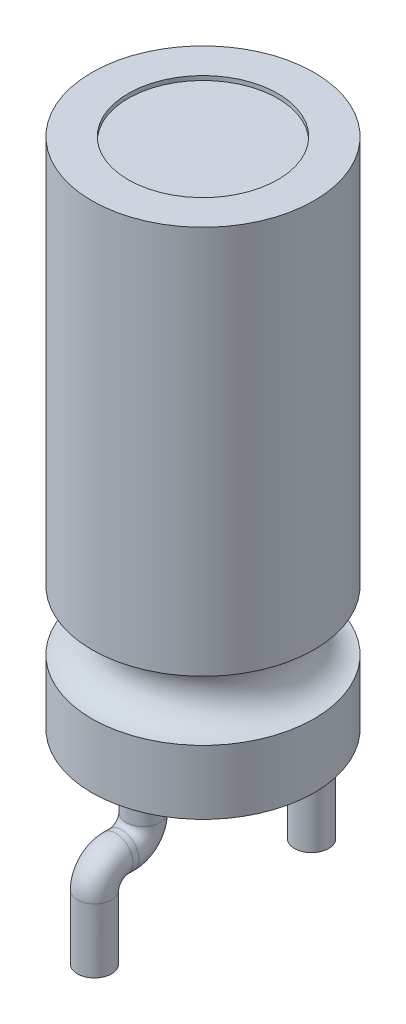
ISO-10303-21;
HEADER;
FILE_DESCRIPTION(('STEP AP214'),'2;1');
FILE_NAME('part.step','',(''),(''),'','','');
FILE_SCHEMA(('AUTOMOTIVE_DESIGN { 1 0 10303 214 1 1 1 1 }'));
ENDSEC;
DATA;
#1=APPLICATION_CONTEXT('core data for automotive mechanical design processes');
#2=APPLICATION_PROTOCOL_DEFINITION('international standard','automotive_design',2000,#1);
#3=PRODUCT_CONTEXT('',#1,'mechanical');
#4=PRODUCT('Part','Part','',(#3));
#5=PRODUCT_RELATED_PRODUCT_CATEGORY('part','',(#4));
#6=PRODUCT_DEFINITION_FORMATION('','',#4);
#7=PRODUCT_DEFINITION_CONTEXT('part definition',#1,'design');
#8=PRODUCT_DEFINITION('design','',#6,#7);
#9=PRODUCT_DEFINITION_SHAPE('','',#8);
#10=(LENGTH_UNIT() NAMED_UNIT(*) SI_UNIT(.MILLI.,.METRE.));
#11=(NAMED_UNIT(*) PLANE_ANGLE_UNIT() SI_UNIT($,.RADIAN.));
#12=(NAMED_UNIT(*) SI_UNIT($,.STERADIAN.) SOLID_ANGLE_UNIT());
#13=UNCERTAINTY_MEASURE_WITH_UNIT(LENGTH_MEASURE(1.E-05),#10,'distance_accuracy_value','');
#14=(GEOMETRIC_REPRESENTATION_CONTEXT(3) GLOBAL_UNCERTAINTY_ASSIGNED_CONTEXT((#13)) GLOBAL_UNIT_ASSIGNED_CONTEXT((#10,
#11,#12)) REPRESENTATION_CONTEXT('',''));
#15=CARTESIAN_POINT('',(0.,0.,0.));
#16=DIRECTION('',(0.,0.,1.));
#17=DIRECTION('',(1.,0.,0.));
#18=AXIS2_PLACEMENT_3D('',#15,#16,#17);
#19=CARTESIAN_POINT('',(2.6,27.5164236634825,0.));
#20=DIRECTION('',(0.,1.,0.));
#21=DIRECTION('',(0.,0.,1.));
#22=AXIS2_PLACEMENT_3D('',#19,#20,#21);
#23=PLANE('',#22);
#24=CARTESIAN_POINT('',(0.,27.5164236634825,1.4));
#25=DIRECTION('',(0.,-1.,0.));
#26=DIRECTION('',(0.,0.,-1.));
#27=AXIS2_PLACEMENT_3D('',#24,#25,#26);
#28=CIRCLE('',#27,0.4);
#29=CARTESIAN_POINT('',(0.,27.5164236634825,1.));
#30=VERTEX_POINT('',#29);
#31=EDGE_CURVE('E41',#30,#30,#28,.T.);
#32=ORIENTED_EDGE('',*,*,#31,.F.);
#33=EDGE_LOOP('',(#32));
#34=FACE_BOUND('',#33,.T.);
#35=CARTESIAN_POINT('',(0.,27.5164236634825,0.));
#36=DIRECTION('',(0.,1.,0.));
#37=DIRECTION('',(0.,0.,1.));
#38=AXIS2_PLACEMENT_3D('',#35,#36,#37);
#39=CIRCLE('',#38,2.6);
#40=CARTESIAN_POINT('',(0.,27.5164236634825,2.6));
#41=VERTEX_POINT('',#40);
#42=EDGE_CURVE('E37',#41,#41,#39,.T.);
#43=ORIENTED_EDGE('',*,*,#42,.F.);
#44=EDGE_LOOP('',(#43));
#45=FACE_BOUND('',#44,.T.);
#46=CARTESIAN_POINT('',(0.,27.5164236634825,-1.4));
#47=DIRECTION('',(0.,-1.,0.));
#48=DIRECTION('',(0.,0.,-1.));
#49=AXIS2_PLACEMENT_3D('',#46,#47,#48);
#50=CIRCLE('',#49,0.4);
#51=CARTESIAN_POINT('',(0.,27.5164236634825,-1.8));
#52=VERTEX_POINT('',#51);
#53=EDGE_CURVE('E10',#52,#52,#50,.T.);
#54=ORIENTED_EDGE('',*,*,#53,.F.);
#55=EDGE_LOOP('',(#54));
#56=FACE_BOUND('',#55,.T.);
#57=ADVANCED_FACE('F34',(#34,#45,#56),#23,.F.);
#58=CARTESIAN_POINT('',(0.,48.4017094017094,0.));
#59=DIRECTION('',(0.,1.,0.));
#60=DIRECTION('',(0.,0.,1.));
#61=AXIS2_PLACEMENT_3D('',#58,#59,#60);
#62=CYLINDRICAL_SURFACE('',#61,2.6);
#63=CARTESIAN_POINT('',(0.,29.0164236634825,0.));
#64=DIRECTION('',(0.,1.,0.));
#65=DIRECTION('',(0.,0.,1.));
#66=AXIS2_PLACEMENT_3D('',#63,#64,#65);
#67=CIRCLE('',#66,2.6);
#68=CARTESIAN_POINT('',(0.,29.0164236634825,2.6));
#69=VERTEX_POINT('',#68);
#70=EDGE_CURVE('E89',#69,#69,#67,.T.);
#71=ORIENTED_EDGE('',*,*,#70,.F.);
#72=EDGE_LOOP('',(#71));
#73=FACE_BOUND('',#72,.T.);
#74=ORIENTED_EDGE('',*,*,#42,.T.);
#75=EDGE_LOOP('',(#74));
#76=FACE_BOUND('',#75,.T.);
#77=ADVANCED_FACE('F96',(#73,#76),#62,.T.);
#78=CARTESIAN_POINT('',(0.,29.7164236634825,0.));
#79=DIRECTION('',(0.,1.,0.));
#80=DIRECTION('',(0.,0.,1.));
#81=AXIS2_PLACEMENT_3D('',#78,#79,#80);
#82=TOROIDAL_SURFACE('',#81,2.6,0.699999999999999);
#83=CARTESIAN_POINT('',(0.,30.4164236634825,0.));
#84=DIRECTION('',(0.,1.,0.));
#85=DIRECTION('',(0.,0.,1.));
#86=AXIS2_PLACEMENT_3D('',#83,#84,#85);
#87=CIRCLE('',#86,2.6);
#88=CARTESIAN_POINT('',(0.,30.4164236634825,2.6));
#89=VERTEX_POINT('',#88);
#90=EDGE_CURVE('E87',#89,#89,#87,.T.);
#91=ORIENTED_EDGE('',*,*,#90,.F.);
#92=EDGE_LOOP('',(#91));
#93=FACE_BOUND('',#92,.T.);
#94=ORIENTED_EDGE('',*,*,#70,.T.);
#95=EDGE_LOOP('',(#94));
#96=FACE_BOUND('',#95,.T.);
#97=ADVANCED_FACE('F104',(#93,#96),#82,.F.);
#98=CARTESIAN_POINT('',(0.,48.4017094017094,0.));
#99=DIRECTION('',(0.,1.,0.));
#100=DIRECTION('',(0.,0.,1.));
#101=AXIS2_PLACEMENT_3D('',#98,#99,#100);
#102=CYLINDRICAL_SURFACE('',#101,2.6);
#103=CARTESIAN_POINT('',(0.,39.5164236634825,0.));
#104=DIRECTION('',(0.,1.,0.));
#105=DIRECTION('',(0.,0.,1.));
#106=AXIS2_PLACEMENT_3D('',#103,#104,#105);
#107=CIRCLE('',#106,2.6);
#108=CARTESIAN_POINT('',(0.,39.5164236634825,2.6));
#109=VERTEX_POINT('',#108);
#110=EDGE_CURVE('E84',#109,#109,#107,.T.);
#111=ORIENTED_EDGE('',*,*,#110,.F.);
#112=EDGE_LOOP('',(#111));
#113=FACE_BOUND('',#112,.T.);
#114=ORIENTED_EDGE('',*,*,#90,.T.);
#115=EDGE_LOOP('',(#114));
#116=FACE_BOUND('',#115,.T.);
#117=ADVANCED_FACE('F149',(#113,#116),#102,.T.);
#118=CARTESIAN_POINT('',(0.,39.5164236634825,0.));
#119=DIRECTION('',(0.,-1.,0.));
#120=DIRECTION('',(0.,0.,-1.));
#121=AXIS2_PLACEMENT_3D('',#118,#119,#120);
#122=PLANE('',#121);
#123=CARTESIAN_POINT('',(0.,39.5164236634825,0.));
#124=DIRECTION('',(0.,1.,0.));
#125=DIRECTION('',(0.,0.,1.));
#126=AXIS2_PLACEMENT_3D('',#123,#124,#125);
#127=CIRCLE('',#126,1.75);
#128=CARTESIAN_POINT('',(0.,39.5164236634825,1.75));
#129=VERTEX_POINT('',#128);
#130=EDGE_CURVE('E78',#129,#129,#127,.T.);
#131=ORIENTED_EDGE('',*,*,#130,.F.);
#132=EDGE_LOOP('',(#131));
#133=FACE_BOUND('',#132,.T.);
#134=ORIENTED_EDGE('',*,*,#110,.T.);
#135=EDGE_LOOP('',(#134));
#136=FACE_BOUND('',#135,.T.);
#137=ADVANCED_FACE('F145',(#133,#136),#122,.F.);
#138=CARTESIAN_POINT('',(0.,39.4164236634825,0.));
#139=DIRECTION('',(0.,1.,0.));
#140=DIRECTION('',(0.,0.,1.));
#141=AXIS2_PLACEMENT_3D('',#138,#139,#140);
#142=CYLINDRICAL_SURFACE('',#141,1.75);
#143=CARTESIAN_POINT('',(0.,39.4164236634825,0.));
#144=DIRECTION('',(0.,1.,0.));
#145=DIRECTION('',(0.,0.,1.));
#146=AXIS2_PLACEMENT_3D('',#143,#144,#145);
#147=CIRCLE('',#146,1.75);
#148=CARTESIAN_POINT('',(0.,39.4164236634825,1.75));
#149=VERTEX_POINT('',#148);
#150=EDGE_CURVE('E81',#149,#149,#147,.T.);
#151=ORIENTED_EDGE('',*,*,#150,.F.);
#152=EDGE_LOOP('',(#151));
#153=FACE_BOUND('',#152,.T.);
#154=ORIENTED_EDGE('',*,*,#130,.T.);
#155=EDGE_LOOP('',(#154));
#156=FACE_BOUND('',#155,.T.);
#157=ADVANCED_FACE('F141',(#153,#156),#142,.F.);
#158=CARTESIAN_POINT('',(0.,39.4164236634825,0.));
#159=DIRECTION('',(0.,1.,0.));
#160=DIRECTION('',(0.,0.,1.));
#161=AXIS2_PLACEMENT_3D('',#158,#159,#160);
#162=PLANE('',#161);
#163=ORIENTED_EDGE('',*,*,#150,.T.);
#164=EDGE_LOOP('',(#163));
#165=FACE_BOUND('',#164,.T.);
#166=ADVANCED_FACE('F137',(#165),#162,.T.);
#167=CARTESIAN_POINT('',(0.,25.5164236634825,2.54));
#168=DIRECTION('',(0.,-1.,0.));
#169=DIRECTION('',(0.,0.,-1.));
#170=AXIS2_PLACEMENT_3D('',#167,#168,#169);
#171=CYLINDRICAL_SURFACE('',#170,0.4);
#172=CARTESIAN_POINT('',(0.,25.5164236634825,2.54));
#173=DIRECTION('',(0.,-1.,0.));
#174=DIRECTION('',(0.,0.,-1.));
#175=AXIS2_PLACEMENT_3D('',#172,#173,#174);
#176=CIRCLE('',#175,0.4);
#177=CARTESIAN_POINT('',(0.,25.5164236634825,2.94));
#178=VERTEX_POINT('',#177);
#179=EDGE_CURVE('E72',#178,#178,#176,.T.);
#180=ORIENTED_EDGE('',*,*,#179,.T.);
#181=EDGE_LOOP('',(#180));
#182=FACE_BOUND('',#181,.T.);
#183=CARTESIAN_POINT('',(0.,24.0164236634825,2.54));
#184=DIRECTION('',(0.,-1.,0.));
#185=DIRECTION('',(0.,0.,-1.));
#186=AXIS2_PLACEMENT_3D('',#183,#184,#185);
#187=CIRCLE('',#186,0.4);
#188=CARTESIAN_POINT('',(0.,24.0164236634825,2.14));
#189=VERTEX_POINT('',#188);
#190=EDGE_CURVE('E75',#189,#189,#187,.T.);
#191=ORIENTED_EDGE('',*,*,#190,.F.);
#192=EDGE_LOOP('',(#191));
#193=FACE_BOUND('',#192,.T.);
#194=ADVANCED_FACE('F133',(#182,#193),#171,.T.);
#195=CARTESIAN_POINT('',(0.,25.5164236634825,2.04));
#196=DIRECTION('',(1.,0.,0.));
#197=DIRECTION('',(0.,0.,-1.));
#198=AXIS2_PLACEMENT_3D('',#195,#196,#197);
#199=TOROIDAL_SURFACE('',#198,0.500000000000004,0.4);
#200=CARTESIAN_POINT('',(0.,26.0164236634825,2.04));
#201=DIRECTION('',(0.,0.,1.));
#202=DIRECTION('',(0.,-1.,0.));
#203=AXIS2_PLACEMENT_3D('',#200,#201,#202);
#204=CIRCLE('',#203,0.4);
#205=CARTESIAN_POINT('',(0.,26.4164236634825,2.03999999999999));
#206=VERTEX_POINT('',#205);
#207=EDGE_CURVE('E69',#206,#206,#204,.T.);
#208=CARTESIAN_POINT('',(0.,25.5164236634825,2.04));
#209=DIRECTION('',(1.,0.,0.));
#210=DIRECTION('',(0.,0.,-1.));
#211=AXIS2_PLACEMENT_3D('',#208,#209,#210);
#212=CIRCLE('',#211,0.900000000000004);
#213=EDGE_CURVE('',#206,#178,#212,.T.);
#214=ORIENTED_EDGE('',*,*,#207,.T.);
#215=ORIENTED_EDGE('',*,*,#179,.F.);
#216=ORIENTED_EDGE('',*,*,#213,.T.);
#217=ORIENTED_EDGE('',*,*,#213,.F.);
#218=EDGE_LOOP('',(#214,#216,#215,#217));
#219=FACE_BOUND('',#218,.T.);
#220=ADVANCED_FACE('F129',(#219),#199,.T.);
#221=CARTESIAN_POINT('',(0.,26.0164236634825,1.90000000000003));
#222=DIRECTION('',(0.,0.,1.));
#223=DIRECTION('',(1.,0.,0.));
#224=AXIS2_PLACEMENT_3D('',#221,#222,#223);
#225=CYLINDRICAL_SURFACE('',#224,0.4);
#226=CARTESIAN_POINT('',(0.,26.0164236634825,1.90000000000003));
#227=DIRECTION('',(0.,0.,1.));
#228=DIRECTION('',(0.,-1.,0.));
#229=AXIS2_PLACEMENT_3D('',#226,#227,#228);
#230=CIRCLE('',#229,0.4);
#231=CARTESIAN_POINT('',(0.,25.6164236634825,1.90000000000005));
#232=VERTEX_POINT('',#231);
#233=EDGE_CURVE('E66',#232,#232,#230,.T.);
#234=ORIENTED_EDGE('',*,*,#233,.T.);
#235=EDGE_LOOP('',(#234));
#236=FACE_BOUND('',#235,.T.);
#237=ORIENTED_EDGE('',*,*,#207,.F.);
#238=EDGE_LOOP('',(#237));
#239=FACE_BOUND('',#238,.T.);
#240=ADVANCED_FACE('F121',(#236,#239),#225,.T.);
#241=CARTESIAN_POINT('',(0.,26.5164236634825,1.9));
#242=DIRECTION('',(-1.,0.,0.));
#243=DIRECTION('',(0.,0.,1.));
#244=AXIS2_PLACEMENT_3D('',#241,#242,#243);
#245=TOROIDAL_SURFACE('',#244,0.5,0.4);
#246=CARTESIAN_POINT('',(0.,26.5164236634825,1.4));
#247=DIRECTION('',(0.,-1.,0.));
#248=DIRECTION('',(0.,0.,-1.));
#249=AXIS2_PLACEMENT_3D('',#246,#247,#248);
#250=CIRCLE('',#249,0.4);
#251=CARTESIAN_POINT('',(0.,26.5164236634825,1.));
#252=VERTEX_POINT('',#251);
#253=EDGE_CURVE('E62',#252,#252,#250,.T.);
#254=CARTESIAN_POINT('',(0.,26.5164236634825,1.9));
#255=DIRECTION('',(-1.,0.,0.));
#256=DIRECTION('',(0.,0.,1.));
#257=AXIS2_PLACEMENT_3D('',#254,#255,#256);
#258=CIRCLE('',#257,0.9);
#259=EDGE_CURVE('',#252,#232,#258,.T.);
#260=ORIENTED_EDGE('',*,*,#253,.T.);
#261=ORIENTED_EDGE('',*,*,#233,.F.);
#262=ORIENTED_EDGE('',*,*,#259,.T.);
#263=ORIENTED_EDGE('',*,*,#259,.F.);
#264=EDGE_LOOP('',(#260,#262,#261,#263));
#265=FACE_BOUND('',#264,.T.);
#266=ADVANCED_FACE('F111',(#265),#245,.T.);
#267=CARTESIAN_POINT('',(0.,26.5164236634825,1.4));
#268=DIRECTION('',(0.,1.,0.));
#269=DIRECTION('',(0.,0.,1.));
#270=AXIS2_PLACEMENT_3D('',#267,#268,#269);
#271=CYLINDRICAL_SURFACE('',#270,0.4);
#272=ORIENTED_EDGE('',*,*,#253,.F.);
#273=EDGE_LOOP('',(#272));
#274=FACE_BOUND('',#273,.T.);
#275=ORIENTED_EDGE('',*,*,#31,.T.);
#276=EDGE_LOOP('',(#275));
#277=FACE_BOUND('',#276,.T.);
#278=ADVANCED_FACE('F108',(#274,#277),#271,.T.);
#279=CARTESIAN_POINT('',(0.,24.0164236634825,2.54));
#280=DIRECTION('',(0.,-1.,0.));
#281=DIRECTION('',(0.,0.,-1.));
#282=AXIS2_PLACEMENT_3D('',#279,#280,#281);
#283=PLANE('',#282);
#284=ORIENTED_EDGE('',*,*,#190,.T.);
#285=EDGE_LOOP('',(#284));
#286=FACE_BOUND('',#285,.T.);
#287=ADVANCED_FACE('F110',(#286),#283,.T.);
#288=CARTESIAN_POINT('',(0.,25.5164236634825,-2.54));
#289=DIRECTION('',(0.,-1.,0.));
#290=DIRECTION('',(0.,0.,-1.));
#291=AXIS2_PLACEMENT_3D('',#288,#289,#290);
#292=CYLINDRICAL_SURFACE('',#291,0.4);
#293=CARTESIAN_POINT('',(0.,25.5164236634825,-2.54));
#294=DIRECTION('',(0.,-1.,0.));
#295=DIRECTION('',(0.,0.,-1.));
#296=AXIS2_PLACEMENT_3D('',#293,#294,#295);
#297=CIRCLE('',#296,0.4);
#298=CARTESIAN_POINT('',(0.,25.5164236634825,-2.94));
#299=VERTEX_POINT('',#298);
#300=EDGE_CURVE('E57',#299,#299,#297,.T.);
#301=ORIENTED_EDGE('',*,*,#300,.T.);
#302=EDGE_LOOP('',(#301));
#303=FACE_BOUND('',#302,.T.);
#304=CARTESIAN_POINT('',(0.,24.0164236634825,-2.54));
#305=DIRECTION('',(0.,-1.,0.));
#306=DIRECTION('',(0.,0.,-1.));
#307=AXIS2_PLACEMENT_3D('',#304,#305,#306);
#308=CIRCLE('',#307,0.4);
#309=CARTESIAN_POINT('',(0.,24.0164236634825,-2.94));
#310=VERTEX_POINT('',#309);
#311=EDGE_CURVE('E60',#310,#310,#308,.T.);
#312=ORIENTED_EDGE('',*,*,#311,.F.);
#313=EDGE_LOOP('',(#312));
#314=FACE_BOUND('',#313,.T.);
#315=ADVANCED_FACE('F118',(#303,#314),#292,.T.);
#316=CARTESIAN_POINT('',(0.,25.5164236634825,-2.04));
#317=DIRECTION('',(-1.,0.,0.));
#318=DIRECTION('',(0.,0.,1.));
#319=AXIS2_PLACEMENT_3D('',#316,#317,#318);
#320=TOROIDAL_SURFACE('',#319,0.500000000000004,0.4);
#321=CARTESIAN_POINT('',(0.,26.0164236634825,-2.03999999999999));
#322=DIRECTION('',(0.,0.,-1.));
#323=DIRECTION('',(0.,1.,0.));
#324=AXIS2_PLACEMENT_3D('',#321,#322,#323);
#325=CIRCLE('',#324,0.4);
#326=CARTESIAN_POINT('',(0.,26.4164236634825,-2.03999999999999));
#327=VERTEX_POINT('',#326);
#328=EDGE_CURVE('E54',#327,#327,#325,.T.);
#329=CARTESIAN_POINT('',(0.,25.5164236634825,-2.04));
#330=DIRECTION('',(-1.,0.,0.));
#331=DIRECTION('',(0.,0.,1.));
#332=AXIS2_PLACEMENT_3D('',#329,#330,#331);
#333=CIRCLE('',#332,0.900000000000004);
#334=EDGE_CURVE('',#327,#299,#333,.T.);
#335=ORIENTED_EDGE('',*,*,#328,.T.);
#336=ORIENTED_EDGE('',*,*,#300,.F.);
#337=ORIENTED_EDGE('',*,*,#334,.T.);
#338=ORIENTED_EDGE('',*,*,#334,.F.);
#339=EDGE_LOOP('',(#335,#337,#336,#338));
#340=FACE_BOUND('',#339,.T.);
#341=ADVANCED_FACE('F214',(#340),#320,.T.);
#342=CARTESIAN_POINT('',(0.,26.0164236634825,-1.9));
#343=DIRECTION('',(0.,0.,-1.));
#344=DIRECTION('',(-1.,0.,0.));
#345=AXIS2_PLACEMENT_3D('',#342,#343,#344);
#346=CYLINDRICAL_SURFACE('',#345,0.4);
#347=CARTESIAN_POINT('',(0.,26.0164236634825,-1.9));
#348=DIRECTION('',(0.,0.,-1.));
#349=DIRECTION('',(0.,1.,0.));
#350=AXIS2_PLACEMENT_3D('',#347,#348,#349);
#351=CIRCLE('',#350,0.4);
#352=CARTESIAN_POINT('',(0.,25.6164236634825,-1.9));
#353=VERTEX_POINT('',#352);
#354=EDGE_CURVE('E51',#353,#353,#351,.T.);
#355=ORIENTED_EDGE('',*,*,#354,.T.);
#356=EDGE_LOOP('',(#355));
#357=FACE_BOUND('',#356,.T.);
#358=ORIENTED_EDGE('',*,*,#328,.F.);
#359=EDGE_LOOP('',(#358));
#360=FACE_BOUND('',#359,.T.);
#361=ADVANCED_FACE('F223',(#357,#360),#346,.T.);
#362=CARTESIAN_POINT('',(0.,26.5164236634825,-1.9));
#363=DIRECTION('',(1.,0.,0.));
#364=DIRECTION('',(0.,0.,-1.));
#365=AXIS2_PLACEMENT_3D('',#362,#363,#364);
#366=TOROIDAL_SURFACE('',#365,0.5,0.4);
#367=CARTESIAN_POINT('',(0.,26.5164236634825,-1.4));
#368=DIRECTION('',(0.,-1.,0.));
#369=DIRECTION('',(0.,0.,-1.));
#370=AXIS2_PLACEMENT_3D('',#367,#368,#369);
#371=CIRCLE('',#370,0.4);
#372=CARTESIAN_POINT('',(0.,26.5164236634825,-0.999999999999999));
#373=VERTEX_POINT('',#372);
#374=EDGE_CURVE('E48',#373,#373,#371,.T.);
#375=CARTESIAN_POINT('',(0.,26.5164236634825,-1.9));
#376=DIRECTION('',(1.,0.,0.));
#377=DIRECTION('',(0.,0.,-1.));
#378=AXIS2_PLACEMENT_3D('',#375,#376,#377);
#379=CIRCLE('',#378,0.9);
#380=EDGE_CURVE('',#373,#353,#379,.T.);
#381=ORIENTED_EDGE('',*,*,#374,.T.);
#382=ORIENTED_EDGE('',*,*,#354,.F.);
#383=ORIENTED_EDGE('',*,*,#380,.T.);
#384=ORIENTED_EDGE('',*,*,#380,.F.);
#385=EDGE_LOOP('',(#381,#383,#382,#384));
#386=FACE_BOUND('',#385,.T.);
#387=ADVANCED_FACE('F233',(#386),#366,.T.);
#388=CARTESIAN_POINT('',(0.,26.5164236634825,-1.4));
#389=DIRECTION('',(0.,1.,0.));
#390=DIRECTION('',(0.,0.,1.));
#391=AXIS2_PLACEMENT_3D('',#388,#389,#390);
#392=CYLINDRICAL_SURFACE('',#391,0.4);
#393=ORIENTED_EDGE('',*,*,#374,.F.);
#394=EDGE_LOOP('',(#393));
#395=FACE_BOUND('',#394,.T.);
#396=ORIENTED_EDGE('',*,*,#53,.T.);
#397=EDGE_LOOP('',(#396));
#398=FACE_BOUND('',#397,.T.);
#399=ADVANCED_FACE('F243',(#395,#398),#392,.T.);
#400=CARTESIAN_POINT('',(0.,24.0164236634825,-2.54));
#401=DIRECTION('',(0.,-1.,0.));
#402=DIRECTION('',(0.,0.,-1.));
#403=AXIS2_PLACEMENT_3D('',#400,#401,#402);
#404=PLANE('',#403);
#405=ORIENTED_EDGE('',*,*,#311,.T.);
#406=EDGE_LOOP('',(#405));
#407=FACE_BOUND('',#406,.T.);
#408=ADVANCED_FACE('F253',(#407),#404,.T.);
#409=CLOSED_SHELL('',(#57,#77,#97,#117,#137,#157,#166,#194,#220,#240,#266,#278,#287,#315,#341,
#361,#387,#399,#408));
#410=MANIFOLD_SOLID_BREP('B2',#409);
#411=ADVANCED_BREP_SHAPE_REPRESENTATION('',(#18,#410),#14);
#412=SHAPE_DEFINITION_REPRESENTATION(#9,#411);
ENDSEC;
END-ISO-10303-21;
